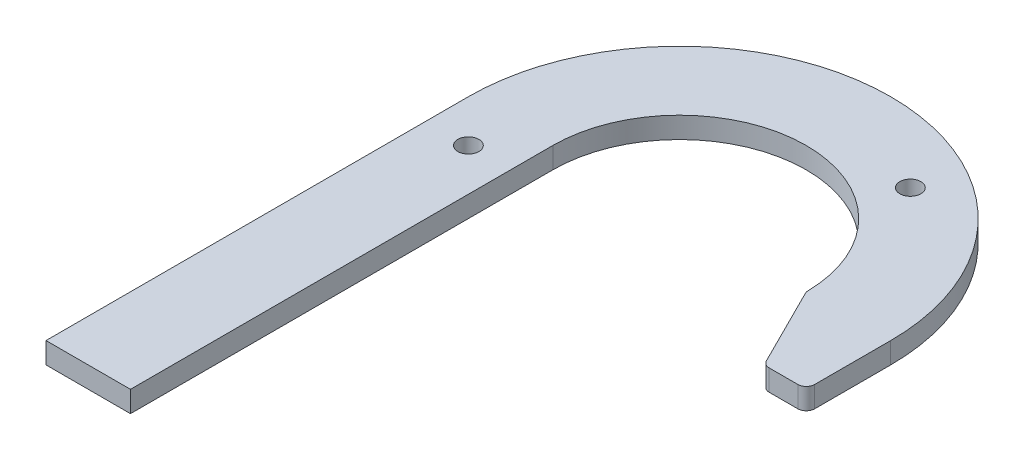
ISO-10303-21;
HEADER;
FILE_DESCRIPTION(('STEP AP214'),'2;1');
FILE_NAME('part.step','',(''),(''),'','','');
FILE_SCHEMA(('AUTOMOTIVE_DESIGN { 1 0 10303 214 1 1 1 1 }'));
ENDSEC;
DATA;
#1=APPLICATION_CONTEXT('core data for automotive mechanical design processes');
#2=APPLICATION_PROTOCOL_DEFINITION('international standard','automotive_design',2000,#1);
#3=PRODUCT_CONTEXT('',#1,'mechanical');
#4=PRODUCT('Part','Part','',(#3));
#5=PRODUCT_RELATED_PRODUCT_CATEGORY('part','',(#4));
#6=PRODUCT_DEFINITION_FORMATION('','',#4);
#7=PRODUCT_DEFINITION_CONTEXT('part definition',#1,'design');
#8=PRODUCT_DEFINITION('design','',#6,#7);
#9=PRODUCT_DEFINITION_SHAPE('','',#8);
#10=(LENGTH_UNIT() NAMED_UNIT(*) SI_UNIT(.MILLI.,.METRE.));
#11=(NAMED_UNIT(*) PLANE_ANGLE_UNIT() SI_UNIT($,.RADIAN.));
#12=(NAMED_UNIT(*) SI_UNIT($,.STERADIAN.) SOLID_ANGLE_UNIT());
#13=UNCERTAINTY_MEASURE_WITH_UNIT(LENGTH_MEASURE(1.E-05),#10,'distance_accuracy_value','');
#14=(GEOMETRIC_REPRESENTATION_CONTEXT(3) GLOBAL_UNCERTAINTY_ASSIGNED_CONTEXT((#13)) GLOBAL_UNIT_ASSIGNED_CONTEXT((#10,
#11,#12)) REPRESENTATION_CONTEXT('',''));
#15=CARTESIAN_POINT('',(0.,0.,0.));
#16=DIRECTION('',(0.,0.,1.));
#17=DIRECTION('',(1.,0.,0.));
#18=AXIS2_PLACEMENT_3D('',#15,#16,#17);
#19=CARTESIAN_POINT('',(90.4698063314248,0.,-46.6577689194679));
#20=DIRECTION('',(0.,1.,0.));
#21=DIRECTION('',(0.,0.,1.));
#22=AXIS2_PLACEMENT_3D('',#19,#20,#21);
#23=CYLINDRICAL_SURFACE('',#22,2.54);
#24=CARTESIAN_POINT('',(90.4698063314248,6.35,-46.6577689194679));
#25=DIRECTION('',(0.,1.,0.));
#26=DIRECTION('',(0.,0.,1.));
#27=AXIS2_PLACEMENT_3D('',#24,#25,#26);
#28=CIRCLE('',#27,2.54);
#29=CARTESIAN_POINT('',(88.197961266285,6.35,-45.521846386898));
#30=VERTEX_POINT('',#29);
#31=CARTESIAN_POINT('',(90.4698063314248,6.35,-44.1177689194679));
#32=VERTEX_POINT('',#31);
#33=EDGE_CURVE('E164',#30,#32,#28,.T.);
#34=ORIENTED_EDGE('',*,*,#33,.F.);
#35=DIRECTION('',(0.,1.,0.));
#36=VECTOR('',#35,1.);
#37=CARTESIAN_POINT('',(88.197961266285,0.,-45.521846386898));
#38=LINE('',#37,#36);
#39=CARTESIAN_POINT('',(88.197961266285,0.,-45.521846386898));
#40=VERTEX_POINT('',#39);
#41=EDGE_CURVE('E11',#40,#30,#38,.T.);
#42=ORIENTED_EDGE('',*,*,#41,.F.);
#43=CARTESIAN_POINT('',(90.4698063314248,0.,-46.6577689194679));
#44=DIRECTION('',(0.,1.,0.));
#45=DIRECTION('',(0.,0.,1.));
#46=AXIS2_PLACEMENT_3D('',#43,#44,#45);
#47=CIRCLE('',#46,2.54);
#48=CARTESIAN_POINT('',(90.4698063314248,0.,-44.1177689194679));
#49=VERTEX_POINT('',#48);
#50=EDGE_CURVE('E205',#40,#49,#47,.T.);
#51=ORIENTED_EDGE('',*,*,#50,.T.);
#52=DIRECTION('',(0.,1.,0.));
#53=VECTOR('',#52,1.);
#54=CARTESIAN_POINT('',(90.4698063314248,0.,-44.1177689194679));
#55=LINE('',#54,#53);
#56=EDGE_CURVE('E46',#49,#32,#55,.T.);
#57=ORIENTED_EDGE('',*,*,#56,.T.);
#58=EDGE_LOOP('',(#34,#42,#51,#57));
#59=FACE_BOUND('',#58,.T.);
#60=ADVANCED_FACE('F43',(#59),#23,.T.);
#61=CARTESIAN_POINT('',(76.4635957029309,0.,-68.9905775136062));
#62=DIRECTION('',(-0.894427190999916,0.,0.447213595499958));
#63=DIRECTION('',(0.447213595499958,0.,0.894427190999916));
#64=AXIS2_PLACEMENT_3D('',#61,#62,#63);
#65=PLANE('',#64);
#66=DIRECTION('',(0.447213595499958,0.,0.894427190999916));
#67=VECTOR('',#66,1.);
#68=CARTESIAN_POINT('',(76.4635957029309,6.35,-68.9905775136062));
#69=LINE('',#68,#67);
#70=CARTESIAN_POINT('',(76.4635957029309,6.35,-68.9905775136062));
#71=VERTEX_POINT('',#70);
#72=EDGE_CURVE('E202',#71,#30,#69,.T.);
#73=ORIENTED_EDGE('',*,*,#72,.F.);
#74=DIRECTION('',(0.,1.,0.));
#75=VECTOR('',#74,1.);
#76=CARTESIAN_POINT('',(76.4635957029309,0.,-68.9905775136062));
#77=LINE('',#76,#75);
#78=CARTESIAN_POINT('',(76.4635957029309,0.,-68.9905775136062));
#79=VERTEX_POINT('',#78);
#80=EDGE_CURVE('E53',#79,#71,#77,.T.);
#81=ORIENTED_EDGE('',*,*,#80,.F.);
#82=DIRECTION('',(0.447213595499958,0.,0.894427190999916));
#83=VECTOR('',#82,1.);
#84=CARTESIAN_POINT('',(76.4635957029309,0.,-68.9905775136062));
#85=LINE('',#84,#83);
#86=EDGE_CURVE('E150',#79,#40,#85,.T.);
#87=ORIENTED_EDGE('',*,*,#86,.T.);
#88=ORIENTED_EDGE('',*,*,#41,.T.);
#89=EDGE_LOOP('',(#73,#81,#87,#88));
#90=FACE_BOUND('',#89,.T.);
#91=ADVANCED_FACE('F232',(#90),#65,.T.);
#92=CARTESIAN_POINT('',(78.7354407680706,0.,-70.1265000461761));
#93=DIRECTION('',(0.,1.,0.));
#94=DIRECTION('',(0.,0.,1.));
#95=AXIS2_PLACEMENT_3D('',#92,#93,#94);
#96=CYLINDRICAL_SURFACE('',#95,2.53999999999997);
#97=CARTESIAN_POINT('',(78.7354407680706,6.35,-70.1265000461761));
#98=DIRECTION('',(0.,1.,0.));
#99=DIRECTION('',(0.,0.,1.));
#100=AXIS2_PLACEMENT_3D('',#97,#98,#99);
#101=CIRCLE('',#100,2.53999999999997);
#102=CARTESIAN_POINT('',(76.1957257200662,6.35,-70.0884543507568));
#103=VERTEX_POINT('',#102);
#104=EDGE_CURVE('E136',#103,#71,#101,.T.);
#105=ORIENTED_EDGE('',*,*,#104,.F.);
#106=DIRECTION('',(0.,1.,0.));
#107=VECTOR('',#106,1.);
#108=CARTESIAN_POINT('',(76.1957257200662,0.,-70.0884543507568));
#109=LINE('',#108,#107);
#110=CARTESIAN_POINT('',(76.1957257200662,0.,-70.0884543507568));
#111=VERTEX_POINT('',#110);
#112=EDGE_CURVE('E131',#111,#103,#109,.T.);
#113=ORIENTED_EDGE('',*,*,#112,.F.);
#114=CARTESIAN_POINT('',(78.7354407680706,0.,-70.1265000461761));
#115=DIRECTION('',(0.,1.,0.));
#116=DIRECTION('',(0.,0.,1.));
#117=AXIS2_PLACEMENT_3D('',#114,#115,#116);
#118=CIRCLE('',#117,2.53999999999997);
#119=EDGE_CURVE('E134',#111,#79,#118,.T.);
#120=ORIENTED_EDGE('',*,*,#119,.T.);
#121=ORIENTED_EDGE('',*,*,#80,.T.);
#122=EDGE_LOOP('',(#105,#113,#120,#121));
#123=FACE_BOUND('',#122,.T.);
#124=ADVANCED_FACE('F133',(#123),#96,.T.);
#125=CARTESIAN_POINT('',(38.1,0.,-69.517768919468));
#126=DIRECTION('',(0.,1.,0.));
#127=DIRECTION('',(0.,0.,1.));
#128=AXIS2_PLACEMENT_3D('',#125,#126,#127);
#129=CYLINDRICAL_SURFACE('',#128,38.1);
#130=CARTESIAN_POINT('',(38.1,6.35,-69.517768919468));
#131=DIRECTION('',(0.,-1.,0.));
#132=DIRECTION('',(0.,0.,-1.));
#133=AXIS2_PLACEMENT_3D('',#130,#131,#132);
#134=CIRCLE('',#133,38.1);
#135=CARTESIAN_POINT('',(0.,6.35,-69.5177689194679));
#136=VERTEX_POINT('',#135);
#137=EDGE_CURVE('E197',#136,#103,#134,.T.);
#138=ORIENTED_EDGE('',*,*,#137,.F.);
#139=DIRECTION('',(0.,1.,0.));
#140=VECTOR('',#139,1.);
#141=CARTESIAN_POINT('',(0.,0.,-69.5177689194679));
#142=LINE('',#141,#140);
#143=CARTESIAN_POINT('',(0.,0.,-69.5177689194679));
#144=VERTEX_POINT('',#143);
#145=EDGE_CURVE('E142',#144,#136,#142,.T.);
#146=ORIENTED_EDGE('',*,*,#145,.F.);
#147=CARTESIAN_POINT('',(38.1,0.,-69.517768919468));
#148=DIRECTION('',(0.,-1.,0.));
#149=DIRECTION('',(0.,0.,-1.));
#150=AXIS2_PLACEMENT_3D('',#147,#148,#149);
#151=CIRCLE('',#150,38.1);
#152=EDGE_CURVE('E148',#144,#111,#151,.T.);
#153=ORIENTED_EDGE('',*,*,#152,.T.);
#154=ORIENTED_EDGE('',*,*,#112,.T.);
#155=EDGE_LOOP('',(#138,#146,#153,#154));
#156=FACE_BOUND('',#155,.T.);
#157=ADVANCED_FACE('F153',(#156),#129,.F.);
#158=CARTESIAN_POINT('',(0.,0.,57.4822310805321));
#159=DIRECTION('',(1.,0.,0.));
#160=DIRECTION('',(0.,0.,-1.));
#161=AXIS2_PLACEMENT_3D('',#158,#159,#160);
#162=PLANE('',#161);
#163=DIRECTION('',(0.,0.,-1.));
#164=VECTOR('',#163,1.);
#165=CARTESIAN_POINT('',(0.,6.35,57.4822310805321));
#166=LINE('',#165,#164);
#167=CARTESIAN_POINT('',(0.,6.35,57.4822310805321));
#168=VERTEX_POINT('',#167);
#169=EDGE_CURVE('E193',#168,#136,#166,.T.);
#170=ORIENTED_EDGE('',*,*,#169,.F.);
#171=DIRECTION('',(0.,1.,0.));
#172=VECTOR('',#171,1.);
#173=CARTESIAN_POINT('',(0.,0.,57.4822310805321));
#174=LINE('',#173,#172);
#175=CARTESIAN_POINT('',(0.,0.,57.4822310805321));
#176=VERTEX_POINT('',#175);
#177=EDGE_CURVE('E211',#176,#168,#174,.T.);
#178=ORIENTED_EDGE('',*,*,#177,.F.);
#179=DIRECTION('',(0.,0.,-1.));
#180=VECTOR('',#179,1.);
#181=CARTESIAN_POINT('',(0.,0.,57.4822310805321));
#182=LINE('',#181,#180);
#183=EDGE_CURVE('E155',#176,#144,#182,.T.);
#184=ORIENTED_EDGE('',*,*,#183,.T.);
#185=ORIENTED_EDGE('',*,*,#145,.T.);
#186=EDGE_LOOP('',(#170,#178,#184,#185));
#187=FACE_BOUND('',#186,.T.);
#188=ADVANCED_FACE('F245',(#187),#162,.T.);
#189=CARTESIAN_POINT('',(-25.4,0.,57.4822310805321));
#190=DIRECTION('',(0.,0.,1.));
#191=DIRECTION('',(1.,0.,0.));
#192=AXIS2_PLACEMENT_3D('',#189,#190,#191);
#193=PLANE('',#192);
#194=DIRECTION('',(1.,0.,0.));
#195=VECTOR('',#194,1.);
#196=CARTESIAN_POINT('',(-25.4,6.35,57.4822310805321));
#197=LINE('',#196,#195);
#198=CARTESIAN_POINT('',(-25.4,6.35,57.4822310805321));
#199=VERTEX_POINT('',#198);
#200=EDGE_CURVE('E189',#199,#168,#197,.T.);
#201=ORIENTED_EDGE('',*,*,#200,.F.);
#202=DIRECTION('',(0.,1.,0.));
#203=VECTOR('',#202,1.);
#204=CARTESIAN_POINT('',(-25.4,0.,57.4822310805321));
#205=LINE('',#204,#203);
#206=CARTESIAN_POINT('',(-25.4,0.,57.4822310805321));
#207=VERTEX_POINT('',#206);
#208=EDGE_CURVE('E214',#207,#199,#205,.T.);
#209=ORIENTED_EDGE('',*,*,#208,.F.);
#210=DIRECTION('',(1.,0.,0.));
#211=VECTOR('',#210,1.);
#212=CARTESIAN_POINT('',(-25.4,0.,57.4822310805321));
#213=LINE('',#212,#211);
#214=EDGE_CURVE('E158',#207,#176,#213,.T.);
#215=ORIENTED_EDGE('',*,*,#214,.T.);
#216=ORIENTED_EDGE('',*,*,#177,.T.);
#217=EDGE_LOOP('',(#201,#209,#215,#216));
#218=FACE_BOUND('',#217,.T.);
#219=ADVANCED_FACE('F248',(#218),#193,.T.);
#220=CARTESIAN_POINT('',(-25.4,0.,-69.5177689194679));
#221=DIRECTION('',(-1.,0.,0.));
#222=DIRECTION('',(0.,0.,1.));
#223=AXIS2_PLACEMENT_3D('',#220,#221,#222);
#224=PLANE('',#223);
#225=DIRECTION('',(0.,0.,1.));
#226=VECTOR('',#225,1.);
#227=CARTESIAN_POINT('',(-25.4,6.35,-69.5177689194679));
#228=LINE('',#227,#226);
#229=CARTESIAN_POINT('',(-25.4,6.35,-69.5177689194679));
#230=VERTEX_POINT('',#229);
#231=EDGE_CURVE('E185',#230,#199,#228,.T.);
#232=ORIENTED_EDGE('',*,*,#231,.F.);
#233=DIRECTION('',(0.,1.,0.));
#234=VECTOR('',#233,1.);
#235=CARTESIAN_POINT('',(-25.4,0.,-69.5177689194679));
#236=LINE('',#235,#234);
#237=CARTESIAN_POINT('',(-25.4,0.,-69.5177689194679));
#238=VERTEX_POINT('',#237);
#239=EDGE_CURVE('E217',#238,#230,#236,.T.);
#240=ORIENTED_EDGE('',*,*,#239,.F.);
#241=DIRECTION('',(0.,0.,1.));
#242=VECTOR('',#241,1.);
#243=CARTESIAN_POINT('',(-25.4,0.,-69.5177689194679));
#244=LINE('',#243,#242);
#245=EDGE_CURVE('E324',#238,#207,#244,.T.);
#246=ORIENTED_EDGE('',*,*,#245,.T.);
#247=ORIENTED_EDGE('',*,*,#208,.T.);
#248=EDGE_LOOP('',(#232,#240,#246,#247));
#249=FACE_BOUND('',#248,.T.);
#250=ADVANCED_FACE('F252',(#249),#224,.T.);
#251=CARTESIAN_POINT('',(38.1,0.,-69.517768919468));
#252=DIRECTION('',(0.,1.,0.));
#253=DIRECTION('',(0.,0.,1.));
#254=AXIS2_PLACEMENT_3D('',#251,#252,#253);
#255=CYLINDRICAL_SURFACE('',#254,63.5);
#256=CARTESIAN_POINT('',(38.1,6.35,-69.517768919468));
#257=DIRECTION('',(0.,1.,0.));
#258=DIRECTION('',(0.,0.,1.));
#259=AXIS2_PLACEMENT_3D('',#256,#257,#258);
#260=CIRCLE('',#259,63.5);
#261=CARTESIAN_POINT('',(101.6,6.35,-69.5177689194679));
#262=VERTEX_POINT('',#261);
#263=EDGE_CURVE('E181',#262,#230,#260,.T.);
#264=ORIENTED_EDGE('',*,*,#263,.F.);
#265=DIRECTION('',(0.,1.,0.));
#266=VECTOR('',#265,1.);
#267=CARTESIAN_POINT('',(101.6,0.,-69.5177689194679));
#268=LINE('',#267,#266);
#269=CARTESIAN_POINT('',(101.6,0.,-69.5177689194679));
#270=VERTEX_POINT('',#269);
#271=EDGE_CURVE('E220',#270,#262,#268,.T.);
#272=ORIENTED_EDGE('',*,*,#271,.F.);
#273=CARTESIAN_POINT('',(38.1,0.,-69.517768919468));
#274=DIRECTION('',(0.,1.,0.));
#275=DIRECTION('',(0.,0.,1.));
#276=AXIS2_PLACEMENT_3D('',#273,#274,#275);
#277=CIRCLE('',#276,63.5);
#278=EDGE_CURVE('E320',#270,#238,#277,.T.);
#279=ORIENTED_EDGE('',*,*,#278,.T.);
#280=ORIENTED_EDGE('',*,*,#239,.T.);
#281=EDGE_LOOP('',(#264,#272,#279,#280));
#282=FACE_BOUND('',#281,.T.);
#283=ADVANCED_FACE('F256',(#282),#255,.T.);
#284=CARTESIAN_POINT('',(101.6,0.,-46.6577689194679));
#285=DIRECTION('',(1.,0.,0.));
#286=DIRECTION('',(0.,0.,-1.));
#287=AXIS2_PLACEMENT_3D('',#284,#285,#286);
#288=PLANE('',#287);
#289=DIRECTION('',(0.,0.,-1.));
#290=VECTOR('',#289,1.);
#291=CARTESIAN_POINT('',(101.6,6.35,-46.6577689194679));
#292=LINE('',#291,#290);
#293=CARTESIAN_POINT('',(101.6,6.35,-46.6577689194679));
#294=VERTEX_POINT('',#293);
#295=EDGE_CURVE('E177',#294,#262,#292,.T.);
#296=ORIENTED_EDGE('',*,*,#295,.F.);
#297=DIRECTION('',(0.,1.,0.));
#298=VECTOR('',#297,1.);
#299=CARTESIAN_POINT('',(101.6,0.,-46.6577689194679));
#300=LINE('',#299,#298);
#301=CARTESIAN_POINT('',(101.6,0.,-46.6577689194679));
#302=VERTEX_POINT('',#301);
#303=EDGE_CURVE('E223',#302,#294,#300,.T.);
#304=ORIENTED_EDGE('',*,*,#303,.F.);
#305=DIRECTION('',(0.,0.,-1.));
#306=VECTOR('',#305,1.);
#307=CARTESIAN_POINT('',(101.6,0.,-46.6577689194679));
#308=LINE('',#307,#306);
#309=EDGE_CURVE('E316',#302,#270,#308,.T.);
#310=ORIENTED_EDGE('',*,*,#309,.T.);
#311=ORIENTED_EDGE('',*,*,#271,.T.);
#312=EDGE_LOOP('',(#296,#304,#310,#311));
#313=FACE_BOUND('',#312,.T.);
#314=ADVANCED_FACE('F260',(#313),#288,.T.);
#315=CARTESIAN_POINT('',(99.06,0.,-46.6577689194679));
#316=DIRECTION('',(0.,1.,0.));
#317=DIRECTION('',(0.,0.,1.));
#318=AXIS2_PLACEMENT_3D('',#315,#316,#317);
#319=CYLINDRICAL_SURFACE('',#318,2.54);
#320=CARTESIAN_POINT('',(99.06,6.35,-46.6577689194679));
#321=DIRECTION('',(0.,1.,0.));
#322=DIRECTION('',(0.,0.,1.));
#323=AXIS2_PLACEMENT_3D('',#320,#321,#322);
#324=CIRCLE('',#323,2.54);
#325=CARTESIAN_POINT('',(99.06,6.35,-44.1177689194679));
#326=VERTEX_POINT('',#325);
#327=EDGE_CURVE('E173',#326,#294,#324,.T.);
#328=ORIENTED_EDGE('',*,*,#327,.F.);
#329=DIRECTION('',(0.,1.,0.));
#330=VECTOR('',#329,1.);
#331=CARTESIAN_POINT('',(99.06,0.,-44.1177689194679));
#332=LINE('',#331,#330);
#333=CARTESIAN_POINT('',(99.06,0.,-44.1177689194679));
#334=VERTEX_POINT('',#333);
#335=EDGE_CURVE('E225',#334,#326,#332,.T.);
#336=ORIENTED_EDGE('',*,*,#335,.F.);
#337=CARTESIAN_POINT('',(99.06,0.,-46.6577689194679));
#338=DIRECTION('',(0.,1.,0.));
#339=DIRECTION('',(0.,0.,1.));
#340=AXIS2_PLACEMENT_3D('',#337,#338,#339);
#341=CIRCLE('',#340,2.54);
#342=EDGE_CURVE('E312',#334,#302,#341,.T.);
#343=ORIENTED_EDGE('',*,*,#342,.T.);
#344=ORIENTED_EDGE('',*,*,#303,.T.);
#345=EDGE_LOOP('',(#328,#336,#343,#344));
#346=FACE_BOUND('',#345,.T.);
#347=ADVANCED_FACE('F264',(#346),#319,.T.);
#348=CARTESIAN_POINT('',(90.4698063314248,0.,-44.1177689194679));
#349=DIRECTION('',(0.,0.,1.));
#350=DIRECTION('',(1.,0.,0.));
#351=AXIS2_PLACEMENT_3D('',#348,#349,#350);
#352=PLANE('',#351);
#353=DIRECTION('',(1.,0.,0.));
#354=VECTOR('',#353,1.);
#355=CARTESIAN_POINT('',(90.4698063314248,6.35,-44.1177689194679));
#356=LINE('',#355,#354);
#357=EDGE_CURVE('E168',#32,#326,#356,.T.);
#358=ORIENTED_EDGE('',*,*,#357,.F.);
#359=ORIENTED_EDGE('',*,*,#56,.F.);
#360=DIRECTION('',(1.,0.,0.));
#361=VECTOR('',#360,1.);
#362=CARTESIAN_POINT('',(90.4698063314248,0.,-44.1177689194679));
#363=LINE('',#362,#361);
#364=EDGE_CURVE('E309',#49,#334,#363,.T.);
#365=ORIENTED_EDGE('',*,*,#364,.T.);
#366=ORIENTED_EDGE('',*,*,#335,.T.);
#367=EDGE_LOOP('',(#358,#359,#365,#366));
#368=FACE_BOUND('',#367,.T.);
#369=ADVANCED_FACE('F229',(#368),#352,.T.);
#370=CARTESIAN_POINT('',(90.4698063314248,0.,-46.6577689194679));
#371=DIRECTION('',(0.,1.,0.));
#372=DIRECTION('',(0.,0.,1.));
#373=AXIS2_PLACEMENT_3D('',#370,#371,#372);
#374=PLANE('',#373);
#375=CARTESIAN_POINT('',(-12.7,0.,-56.8177689194679));
#376=DIRECTION('',(0.,1.,0.));
#377=DIRECTION('',(0.,0.,-1.));
#378=AXIS2_PLACEMENT_3D('',#375,#376,#377);
#379=CIRCLE('',#378,3.175);
#380=CARTESIAN_POINT('',(-12.7,0.,-59.9927689194679));
#381=VERTEX_POINT('',#380);
#382=EDGE_CURVE('E291',#381,#381,#379,.T.);
#383=ORIENTED_EDGE('',*,*,#382,.T.);
#384=EDGE_LOOP('',(#383));
#385=FACE_BOUND('',#384,.T.);
#386=CARTESIAN_POINT('',(64.743779314167,0.,-112.27066375408));
#387=DIRECTION('',(0.,1.,0.));
#388=DIRECTION('',(0.,0.,-1.));
#389=AXIS2_PLACEMENT_3D('',#386,#387,#388);
#390=CIRCLE('',#389,3.175);
#391=CARTESIAN_POINT('',(64.743779314167,0.,-115.44566375408));
#392=VERTEX_POINT('',#391);
#393=EDGE_CURVE('E169',#392,#392,#390,.T.);
#394=ORIENTED_EDGE('',*,*,#393,.T.);
#395=EDGE_LOOP('',(#394));
#396=FACE_BOUND('',#395,.T.);
#397=ORIENTED_EDGE('',*,*,#50,.F.);
#398=ORIENTED_EDGE('',*,*,#86,.F.);
#399=ORIENTED_EDGE('',*,*,#119,.F.);
#400=ORIENTED_EDGE('',*,*,#152,.F.);
#401=ORIENTED_EDGE('',*,*,#183,.F.);
#402=ORIENTED_EDGE('',*,*,#214,.F.);
#403=ORIENTED_EDGE('',*,*,#245,.F.);
#404=ORIENTED_EDGE('',*,*,#278,.F.);
#405=ORIENTED_EDGE('',*,*,#309,.F.);
#406=ORIENTED_EDGE('',*,*,#342,.F.);
#407=ORIENTED_EDGE('',*,*,#364,.F.);
#408=EDGE_LOOP('',(#397,#398,#399,#400,#401,#402,#403,#404,#405,#406,#407));
#409=FACE_BOUND('',#408,.T.);
#410=ADVANCED_FACE('F146',(#385,#396,#409),#374,.F.);
#411=CARTESIAN_POINT('',(90.4698063314248,6.35,-46.6577689194679));
#412=DIRECTION('',(0.,1.,0.));
#413=DIRECTION('',(0.,0.,1.));
#414=AXIS2_PLACEMENT_3D('',#411,#412,#413);
#415=PLANE('',#414);
#416=CARTESIAN_POINT('',(-12.7,6.35,-56.8177689194679));
#417=DIRECTION('',(0.,1.,0.));
#418=DIRECTION('',(0.,0.,-1.));
#419=AXIS2_PLACEMENT_3D('',#416,#417,#418);
#420=CIRCLE('',#419,3.175);
#421=CARTESIAN_POINT('',(-12.7,6.35,-59.9927689194679));
#422=VERTEX_POINT('',#421);
#423=EDGE_CURVE('E294',#422,#422,#420,.T.);
#424=ORIENTED_EDGE('',*,*,#423,.F.);
#425=EDGE_LOOP('',(#424));
#426=FACE_BOUND('',#425,.T.);
#427=CARTESIAN_POINT('',(64.743779314167,6.35,-112.27066375408));
#428=DIRECTION('',(0.,1.,0.));
#429=DIRECTION('',(0.,0.,-1.));
#430=AXIS2_PLACEMENT_3D('',#427,#428,#429);
#431=CIRCLE('',#430,3.175);
#432=CARTESIAN_POINT('',(64.743779314167,6.35,-115.44566375408));
#433=VERTEX_POINT('',#432);
#434=EDGE_CURVE('E298',#433,#433,#431,.T.);
#435=ORIENTED_EDGE('',*,*,#434,.F.);
#436=EDGE_LOOP('',(#435));
#437=FACE_BOUND('',#436,.T.);
#438=ORIENTED_EDGE('',*,*,#33,.T.);
#439=ORIENTED_EDGE('',*,*,#357,.T.);
#440=ORIENTED_EDGE('',*,*,#327,.T.);
#441=ORIENTED_EDGE('',*,*,#295,.T.);
#442=ORIENTED_EDGE('',*,*,#263,.T.);
#443=ORIENTED_EDGE('',*,*,#231,.T.);
#444=ORIENTED_EDGE('',*,*,#200,.T.);
#445=ORIENTED_EDGE('',*,*,#169,.T.);
#446=ORIENTED_EDGE('',*,*,#137,.T.);
#447=ORIENTED_EDGE('',*,*,#104,.T.);
#448=ORIENTED_EDGE('',*,*,#72,.T.);
#449=EDGE_LOOP('',(#438,#439,#440,#441,#442,#443,#444,#445,#446,#447,#448));
#450=FACE_BOUND('',#449,.T.);
#451=ADVANCED_FACE('F231',(#426,#437,#450),#415,.T.);
#452=CARTESIAN_POINT('',(64.743779314167,0.,-112.27066375408));
#453=DIRECTION('',(0.,1.,0.));
#454=DIRECTION('',(0.,0.,1.));
#455=AXIS2_PLACEMENT_3D('',#452,#453,#454);
#456=CYLINDRICAL_SURFACE('',#455,3.175);
#457=ORIENTED_EDGE('',*,*,#393,.F.);
#458=EDGE_LOOP('',(#457));
#459=FACE_BOUND('',#458,.T.);
#460=ORIENTED_EDGE('',*,*,#434,.T.);
#461=EDGE_LOOP('',(#460));
#462=FACE_BOUND('',#461,.T.);
#463=ADVANCED_FACE('F276',(#459,#462),#456,.F.);
#464=CARTESIAN_POINT('',(-12.7,0.,-56.8177689194679));
#465=DIRECTION('',(0.,1.,0.));
#466=DIRECTION('',(0.,0.,1.));
#467=AXIS2_PLACEMENT_3D('',#464,#465,#466);
#468=CYLINDRICAL_SURFACE('',#467,3.175);
#469=ORIENTED_EDGE('',*,*,#382,.F.);
#470=EDGE_LOOP('',(#469));
#471=FACE_BOUND('',#470,.T.);
#472=ORIENTED_EDGE('',*,*,#423,.T.);
#473=EDGE_LOOP('',(#472));
#474=FACE_BOUND('',#473,.T.);
#475=ADVANCED_FACE('F283',(#471,#474),#468,.F.);
#476=CLOSED_SHELL('',(#60,#91,#124,#157,#188,#219,#250,#283,#314,#347,#369,#410,#451,#463,#475));
#477=MANIFOLD_SOLID_BREP('B2',#476);
#478=ADVANCED_BREP_SHAPE_REPRESENTATION('',(#18,#477),#14);
#479=SHAPE_DEFINITION_REPRESENTATION(#9,#478);
ENDSEC;
END-ISO-10303-21;
